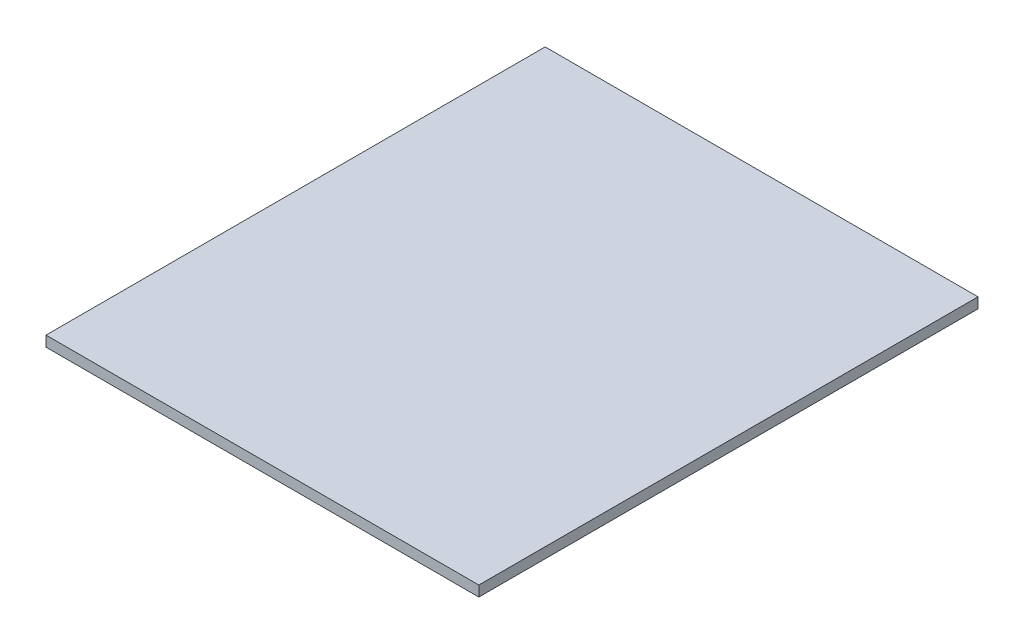
ISO-10303-21;
HEADER;
FILE_DESCRIPTION(('STEP AP214'),'2;1');
FILE_NAME('part.step','',(''),(''),'','','');
FILE_SCHEMA(('AUTOMOTIVE_DESIGN { 1 0 10303 214 1 1 1 1 }'));
ENDSEC;
DATA;
#1=APPLICATION_CONTEXT('core data for automotive mechanical design processes');
#2=APPLICATION_PROTOCOL_DEFINITION('international standard','automotive_design',2000,#1);
#3=PRODUCT_CONTEXT('',#1,'mechanical');
#4=PRODUCT('Part','Part','',(#3));
#5=PRODUCT_RELATED_PRODUCT_CATEGORY('part','',(#4));
#6=PRODUCT_DEFINITION_FORMATION('','',#4);
#7=PRODUCT_DEFINITION_CONTEXT('part definition',#1,'design');
#8=PRODUCT_DEFINITION('design','',#6,#7);
#9=PRODUCT_DEFINITION_SHAPE('','',#8);
#10=(LENGTH_UNIT() NAMED_UNIT(*) SI_UNIT(.MILLI.,.METRE.));
#11=(NAMED_UNIT(*) PLANE_ANGLE_UNIT() SI_UNIT($,.RADIAN.));
#12=(NAMED_UNIT(*) SI_UNIT($,.STERADIAN.) SOLID_ANGLE_UNIT());
#13=UNCERTAINTY_MEASURE_WITH_UNIT(LENGTH_MEASURE(1.E-05),#10,'distance_accuracy_value','');
#14=(GEOMETRIC_REPRESENTATION_CONTEXT(3) GLOBAL_UNCERTAINTY_ASSIGNED_CONTEXT((#13)) GLOBAL_UNIT_ASSIGNED_CONTEXT((#10,
#11,#12)) REPRESENTATION_CONTEXT('',''));
#15=CARTESIAN_POINT('',(0.,0.,0.));
#16=DIRECTION('',(0.,0.,1.));
#17=DIRECTION('',(1.,0.,0.));
#18=AXIS2_PLACEMENT_3D('',#15,#16,#17);
#19=CARTESIAN_POINT('',(0.,5.9944,0.));
#20=DIRECTION('',(1.,0.,0.));
#21=DIRECTION('',(0.,0.,-1.));
#22=AXIS2_PLACEMENT_3D('',#19,#20,#21);
#23=PLANE('',#22);
#24=DIRECTION('',(0.,0.,1.));
#25=VECTOR('',#24,1.);
#26=CARTESIAN_POINT('',(0.,0.,0.));
#27=LINE('',#26,#25);
#28=CARTESIAN_POINT('',(0.,0.,-286.0056));
#29=VERTEX_POINT('',#28);
#30=CARTESIAN_POINT('',(0.,0.,0.));
#31=VERTEX_POINT('',#30);
#32=EDGE_CURVE('E95',#29,#31,#27,.T.);
#33=ORIENTED_EDGE('',*,*,#32,.T.);
#34=DIRECTION('',(0.,-1.,0.));
#35=VECTOR('',#34,1.);
#36=CARTESIAN_POINT('',(0.,5.9944,0.));
#37=LINE('',#36,#35);
#38=CARTESIAN_POINT('',(0.,5.9944,0.));
#39=VERTEX_POINT('',#38);
#40=EDGE_CURVE('E11',#39,#31,#37,.T.);
#41=ORIENTED_EDGE('',*,*,#40,.F.);
#42=DIRECTION('',(0.,0.,1.));
#43=VECTOR('',#42,1.);
#44=CARTESIAN_POINT('',(0.,5.9944,0.));
#45=LINE('',#44,#43);
#46=CARTESIAN_POINT('',(0.,5.9944,-286.0056));
#47=VERTEX_POINT('',#46);
#48=EDGE_CURVE('E83',#47,#39,#45,.T.);
#49=ORIENTED_EDGE('',*,*,#48,.F.);
#50=DIRECTION('',(0.,-1.,0.));
#51=VECTOR('',#50,1.);
#52=CARTESIAN_POINT('',(0.,5.9944,-286.0056));
#53=LINE('',#52,#51);
#54=EDGE_CURVE('E91',#47,#29,#53,.T.);
#55=ORIENTED_EDGE('',*,*,#54,.T.);
#56=EDGE_LOOP('',(#33,#41,#49,#55));
#57=FACE_BOUND('',#56,.T.);
#58=ADVANCED_FACE('F32',(#57),#23,.F.);
#59=CARTESIAN_POINT('',(0.,5.9944,0.));
#60=DIRECTION('',(0.,0.,-1.));
#61=DIRECTION('',(-1.,0.,0.));
#62=AXIS2_PLACEMENT_3D('',#59,#60,#61);
#63=PLANE('',#62);
#64=DIRECTION('',(1.,0.,0.));
#65=VECTOR('',#64,1.);
#66=CARTESIAN_POINT('',(0.,0.,0.));
#67=LINE('',#66,#65);
#68=CARTESIAN_POINT('',(248.0112,0.,0.));
#69=VERTEX_POINT('',#68);
#70=EDGE_CURVE('E87',#31,#69,#67,.T.);
#71=ORIENTED_EDGE('',*,*,#70,.T.);
#72=DIRECTION('',(0.,-1.,0.));
#73=VECTOR('',#72,1.);
#74=CARTESIAN_POINT('',(248.0112,5.9944,0.));
#75=LINE('',#74,#73);
#76=CARTESIAN_POINT('',(248.0112,5.9944,0.));
#77=VERTEX_POINT('',#76);
#78=EDGE_CURVE('E40',#77,#69,#75,.T.);
#79=ORIENTED_EDGE('',*,*,#78,.F.);
#80=DIRECTION('',(1.,0.,0.));
#81=VECTOR('',#80,1.);
#82=CARTESIAN_POINT('',(0.,5.9944,0.));
#83=LINE('',#82,#81);
#84=EDGE_CURVE('E78',#39,#77,#83,.T.);
#85=ORIENTED_EDGE('',*,*,#84,.F.);
#86=ORIENTED_EDGE('',*,*,#40,.T.);
#87=EDGE_LOOP('',(#71,#79,#85,#86));
#88=FACE_BOUND('',#87,.T.);
#89=ADVANCED_FACE('F86',(#88),#63,.F.);
#90=CARTESIAN_POINT('',(248.0112,5.9944,0.));
#91=DIRECTION('',(-1.,0.,0.));
#92=DIRECTION('',(0.,0.,1.));
#93=AXIS2_PLACEMENT_3D('',#90,#91,#92);
#94=PLANE('',#93);
#95=DIRECTION('',(0.,0.,-1.));
#96=VECTOR('',#95,1.);
#97=CARTESIAN_POINT('',(248.0112,0.,0.));
#98=LINE('',#97,#96);
#99=CARTESIAN_POINT('',(248.0112,0.,-286.0056));
#100=VERTEX_POINT('',#99);
#101=EDGE_CURVE('E65',#69,#100,#98,.T.);
#102=ORIENTED_EDGE('',*,*,#101,.T.);
#103=DIRECTION('',(0.,-1.,0.));
#104=VECTOR('',#103,1.);
#105=CARTESIAN_POINT('',(248.0112,5.9944,-286.0056));
#106=LINE('',#105,#104);
#107=CARTESIAN_POINT('',(248.0112,5.9944,-286.0056));
#108=VERTEX_POINT('',#107);
#109=EDGE_CURVE('E88',#108,#100,#106,.T.);
#110=ORIENTED_EDGE('',*,*,#109,.F.);
#111=DIRECTION('',(0.,0.,-1.));
#112=VECTOR('',#111,1.);
#113=CARTESIAN_POINT('',(248.0112,5.9944,0.));
#114=LINE('',#113,#112);
#115=EDGE_CURVE('E81',#77,#108,#114,.T.);
#116=ORIENTED_EDGE('',*,*,#115,.F.);
#117=ORIENTED_EDGE('',*,*,#78,.T.);
#118=EDGE_LOOP('',(#102,#110,#116,#117));
#119=FACE_BOUND('',#118,.T.);
#120=ADVANCED_FACE('F89',(#119),#94,.F.);
#121=CARTESIAN_POINT('',(0.,5.9944,-286.0056));
#122=DIRECTION('',(0.,0.,1.));
#123=DIRECTION('',(1.,0.,0.));
#124=AXIS2_PLACEMENT_3D('',#121,#122,#123);
#125=PLANE('',#124);
#126=DIRECTION('',(-1.,0.,0.));
#127=VECTOR('',#126,1.);
#128=CARTESIAN_POINT('',(0.,0.,-286.0056));
#129=LINE('',#128,#127);
#130=EDGE_CURVE('E71',#100,#29,#129,.T.);
#131=ORIENTED_EDGE('',*,*,#130,.T.);
#132=ORIENTED_EDGE('',*,*,#54,.F.);
#133=DIRECTION('',(-1.,0.,0.));
#134=VECTOR('',#133,1.);
#135=CARTESIAN_POINT('',(0.,5.9944,-286.0056));
#136=LINE('',#135,#134);
#137=EDGE_CURVE('E48',#108,#47,#136,.T.);
#138=ORIENTED_EDGE('',*,*,#137,.F.);
#139=ORIENTED_EDGE('',*,*,#109,.T.);
#140=EDGE_LOOP('',(#131,#132,#138,#139));
#141=FACE_BOUND('',#140,.T.);
#142=ADVANCED_FACE('F102',(#141),#125,.F.);
#143=CARTESIAN_POINT('',(0.,5.9944,0.));
#144=DIRECTION('',(0.,-1.,0.));
#145=DIRECTION('',(0.,0.,-1.));
#146=AXIS2_PLACEMENT_3D('',#143,#144,#145);
#147=PLANE('',#146);
#148=ORIENTED_EDGE('',*,*,#48,.T.);
#149=ORIENTED_EDGE('',*,*,#84,.T.);
#150=ORIENTED_EDGE('',*,*,#115,.T.);
#151=ORIENTED_EDGE('',*,*,#137,.T.);
#152=EDGE_LOOP('',(#148,#149,#150,#151));
#153=FACE_BOUND('',#152,.T.);
#154=ADVANCED_FACE('F79',(#153),#147,.F.);
#155=CARTESIAN_POINT('',(0.,0.,0.));
#156=DIRECTION('',(0.,-1.,0.));
#157=DIRECTION('',(0.,0.,-1.));
#158=AXIS2_PLACEMENT_3D('',#155,#156,#157);
#159=PLANE('',#158);
#160=ORIENTED_EDGE('',*,*,#32,.F.);
#161=ORIENTED_EDGE('',*,*,#130,.F.);
#162=ORIENTED_EDGE('',*,*,#101,.F.);
#163=ORIENTED_EDGE('',*,*,#70,.F.);
#164=EDGE_LOOP('',(#160,#161,#162,#163));
#165=FACE_BOUND('',#164,.T.);
#166=ADVANCED_FACE('F105',(#165),#159,.T.);
#167=CLOSED_SHELL('',(#58,#89,#120,#142,#154,#166));
#168=MANIFOLD_SOLID_BREP('B2',#167);
#169=ADVANCED_BREP_SHAPE_REPRESENTATION('',(#18,#168),#14);
#170=SHAPE_DEFINITION_REPRESENTATION(#9,#169);
ENDSEC;
END-ISO-10303-21;
